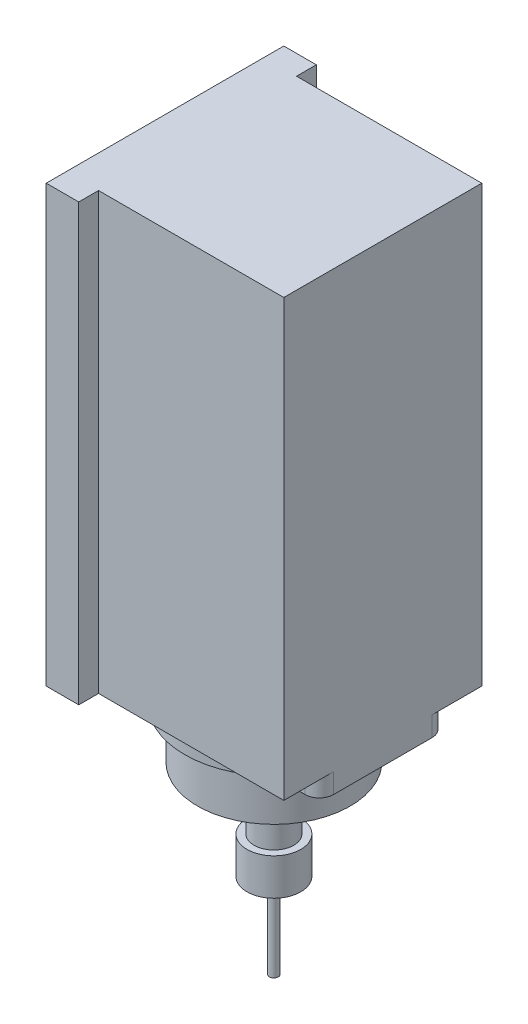
ISO-10303-21;
HEADER;
FILE_DESCRIPTION(('STEP AP214'),'2;1');
FILE_NAME('part.step','',(''),(''),'','','');
FILE_SCHEMA(('AUTOMOTIVE_DESIGN { 1 0 10303 214 1 1 1 1 }'));
ENDSEC;
DATA;
#1=APPLICATION_CONTEXT('core data for automotive mechanical design processes');
#2=APPLICATION_PROTOCOL_DEFINITION('international standard','automotive_design',2000,#1);
#3=PRODUCT_CONTEXT('',#1,'mechanical');
#4=PRODUCT('Part','Part','',(#3));
#5=PRODUCT_RELATED_PRODUCT_CATEGORY('part','',(#4));
#6=PRODUCT_DEFINITION_FORMATION('','',#4);
#7=PRODUCT_DEFINITION_CONTEXT('part definition',#1,'design');
#8=PRODUCT_DEFINITION('design','',#6,#7);
#9=PRODUCT_DEFINITION_SHAPE('','',#8);
#10=(LENGTH_UNIT() NAMED_UNIT(*) SI_UNIT(.MILLI.,.METRE.));
#11=(NAMED_UNIT(*) PLANE_ANGLE_UNIT() SI_UNIT($,.RADIAN.));
#12=(NAMED_UNIT(*) SI_UNIT($,.STERADIAN.) SOLID_ANGLE_UNIT());
#13=UNCERTAINTY_MEASURE_WITH_UNIT(LENGTH_MEASURE(1.E-05),#10,'distance_accuracy_value','');
#14=(GEOMETRIC_REPRESENTATION_CONTEXT(3) GLOBAL_UNCERTAINTY_ASSIGNED_CONTEXT((#13)) GLOBAL_UNIT_ASSIGNED_CONTEXT((#10,
#11,#12)) REPRESENTATION_CONTEXT('',''));
#15=CARTESIAN_POINT('',(0.,0.,0.));
#16=DIRECTION('',(0.,0.,1.));
#17=DIRECTION('',(1.,0.,0.));
#18=AXIS2_PLACEMENT_3D('',#15,#16,#17);
#19=CARTESIAN_POINT('',(0.,0.,0.));
#20=DIRECTION('',(0.,1.,0.));
#21=DIRECTION('',(0.,0.,1.));
#22=AXIS2_PLACEMENT_3D('',#19,#20,#21);
#23=PLANE('',#22);
#24=CARTESIAN_POINT('',(33.5,0.,-17.4264705882353));
#25=DIRECTION('',(0.,-1.,0.));
#26=DIRECTION('',(0.,0.,-1.));
#27=AXIS2_PLACEMENT_3D('',#24,#25,#26);
#28=CIRCLE('',#27,5.);
#29=CARTESIAN_POINT('',(33.5,0.,-22.4264705882353));
#30=VERTEX_POINT('',#29);
#31=CARTESIAN_POINT('',(38.5,0.,-17.4264705882353));
#32=VERTEX_POINT('',#31);
#33=EDGE_CURVE('E49',#30,#32,#28,.T.);
#34=ORIENTED_EDGE('',*,*,#33,.F.);
#35=DIRECTION('',(1.,0.,0.));
#36=VECTOR('',#35,1.);
#37=CARTESIAN_POINT('',(22.1202038181165,0.,-22.4264705882353));
#38=LINE('',#37,#36);
#39=CARTESIAN_POINT('',(22.1202038181165,0.,-22.4264705882353));
#40=VERTEX_POINT('',#39);
#41=EDGE_CURVE('E53',#40,#30,#38,.T.);
#42=ORIENTED_EDGE('',*,*,#41,.F.);
#43=CARTESIAN_POINT('',(0.,0.,0.));
#44=DIRECTION('',(0.,-1.,0.));
#45=DIRECTION('',(0.,0.,-1.));
#46=AXIS2_PLACEMENT_3D('',#43,#44,#45);
#47=CIRCLE('',#46,31.5);
#48=CARTESIAN_POINT('',(-22.1202038181165,0.,-22.4264705882353));
#49=VERTEX_POINT('',#48);
#50=EDGE_CURVE('E311',#49,#40,#47,.T.);
#51=ORIENTED_EDGE('',*,*,#50,.F.);
#52=DIRECTION('',(1.,0.,0.));
#53=VECTOR('',#52,1.);
#54=CARTESIAN_POINT('',(-33.5,0.,-22.4264705882353));
#55=LINE('',#54,#53);
#56=CARTESIAN_POINT('',(-33.5,0.,-22.4264705882353));
#57=VERTEX_POINT('',#56);
#58=EDGE_CURVE('E308',#57,#49,#55,.T.);
#59=ORIENTED_EDGE('',*,*,#58,.F.);
#60=CARTESIAN_POINT('',(-33.5,0.,-17.4264705882353));
#61=DIRECTION('',(0.,-1.,0.));
#62=DIRECTION('',(0.,0.,-1.));
#63=AXIS2_PLACEMENT_3D('',#60,#61,#62);
#64=CIRCLE('',#63,5.);
#65=CARTESIAN_POINT('',(-38.5,0.,-17.4264705882353));
#66=VERTEX_POINT('',#65);
#67=EDGE_CURVE('E305',#66,#57,#64,.T.);
#68=ORIENTED_EDGE('',*,*,#67,.F.);
#69=DIRECTION('',(0.,0.,1.));
#70=VECTOR('',#69,1.);
#71=CARTESIAN_POINT('',(-38.5,0.,-35.));
#72=LINE('',#71,#70);
#73=CARTESIAN_POINT('',(-38.5,0.,-42.));
#74=VERTEX_POINT('',#73);
#75=EDGE_CURVE('E204',#74,#66,#72,.T.);
#76=ORIENTED_EDGE('',*,*,#75,.F.);
#77=DIRECTION('',(-1.,0.,0.));
#78=VECTOR('',#77,1.);
#79=CARTESIAN_POINT('',(-38.5,0.,-42.));
#80=LINE('',#79,#78);
#81=CARTESIAN_POINT('',(-27.,0.,-42.));
#82=VERTEX_POINT('',#81);
#83=EDGE_CURVE('E231',#82,#74,#80,.T.);
#84=ORIENTED_EDGE('',*,*,#83,.F.);
#85=DIRECTION('',(0.,0.,-1.));
#86=VECTOR('',#85,1.);
#87=CARTESIAN_POINT('',(-27.,0.,-42.));
#88=LINE('',#87,#86);
#89=CARTESIAN_POINT('',(-27.,0.,-35.));
#90=VERTEX_POINT('',#89);
#91=EDGE_CURVE('E229',#90,#82,#88,.T.);
#92=ORIENTED_EDGE('',*,*,#91,.F.);
#93=DIRECTION('',(-1.,0.,0.));
#94=VECTOR('',#93,1.);
#95=CARTESIAN_POINT('',(-27.,0.,-35.));
#96=LINE('',#95,#94);
#97=CARTESIAN_POINT('',(38.5,0.,-35.));
#98=VERTEX_POINT('',#97);
#99=EDGE_CURVE('E227',#98,#90,#96,.T.);
#100=ORIENTED_EDGE('',*,*,#99,.F.);
#101=DIRECTION('',(0.,0.,-1.));
#102=VECTOR('',#101,1.);
#103=CARTESIAN_POINT('',(38.5,0.,-35.));
#104=LINE('',#103,#102);
#105=EDGE_CURVE('E223',#32,#98,#104,.T.);
#106=ORIENTED_EDGE('',*,*,#105,.F.);
#107=EDGE_LOOP('',(#34,#42,#51,#59,#68,#76,#84,#92,#100,#106));
#108=FACE_BOUND('',#107,.T.);
#109=ADVANCED_FACE('F32',(#108),#23,.F.);
#110=CARTESIAN_POINT('',(33.5,0.,17.4264705882353));
#111=DIRECTION('',(0.,-1.,0.));
#112=DIRECTION('',(0.,0.,1.));
#113=AXIS2_PLACEMENT_3D('',#110,#111,#112);
#114=CIRCLE('',#113,5.);
#115=CARTESIAN_POINT('',(38.5,0.,17.4264705882353));
#116=VERTEX_POINT('',#115);
#117=CARTESIAN_POINT('',(33.5,0.,22.4264705882353));
#118=VERTEX_POINT('',#117);
#119=EDGE_CURVE('E192',#116,#118,#114,.T.);
#120=ORIENTED_EDGE('',*,*,#119,.F.);
#121=CARTESIAN_POINT('',(38.5,0.,35.));
#122=VERTEX_POINT('',#121);
#123=EDGE_CURVE('E224',#122,#116,#104,.T.);
#124=ORIENTED_EDGE('',*,*,#123,.F.);
#125=DIRECTION('',(1.,0.,0.));
#126=VECTOR('',#125,1.);
#127=CARTESIAN_POINT('',(-27.,0.,35.));
#128=LINE('',#127,#126);
#129=CARTESIAN_POINT('',(-27.,0.,35.));
#130=VERTEX_POINT('',#129);
#131=EDGE_CURVE('E221',#130,#122,#128,.T.);
#132=ORIENTED_EDGE('',*,*,#131,.F.);
#133=DIRECTION('',(0.,0.,-1.));
#134=VECTOR('',#133,1.);
#135=CARTESIAN_POINT('',(-27.,0.,42.));
#136=LINE('',#135,#134);
#137=CARTESIAN_POINT('',(-27.,0.,42.));
#138=VERTEX_POINT('',#137);
#139=EDGE_CURVE('E195',#138,#130,#136,.T.);
#140=ORIENTED_EDGE('',*,*,#139,.F.);
#141=DIRECTION('',(1.,0.,0.));
#142=VECTOR('',#141,1.);
#143=CARTESIAN_POINT('',(-38.5,0.,42.));
#144=LINE('',#143,#142);
#145=CARTESIAN_POINT('',(-38.5,0.,42.));
#146=VERTEX_POINT('',#145);
#147=EDGE_CURVE('E193',#146,#138,#144,.T.);
#148=ORIENTED_EDGE('',*,*,#147,.F.);
#149=CARTESIAN_POINT('',(-38.5,0.,17.4264705882353));
#150=VERTEX_POINT('',#149);
#151=EDGE_CURVE('E233',#150,#146,#72,.T.);
#152=ORIENTED_EDGE('',*,*,#151,.F.);
#153=CARTESIAN_POINT('',(-33.5,0.,17.4264705882353));
#154=DIRECTION('',(0.,-1.,0.));
#155=DIRECTION('',(0.,0.,-1.));
#156=AXIS2_PLACEMENT_3D('',#153,#154,#155);
#157=CIRCLE('',#156,5.);
#158=CARTESIAN_POINT('',(-33.5,0.,22.4264705882353));
#159=VERTEX_POINT('',#158);
#160=EDGE_CURVE('E302',#159,#150,#157,.T.);
#161=ORIENTED_EDGE('',*,*,#160,.F.);
#162=DIRECTION('',(-1.,0.,0.));
#163=VECTOR('',#162,1.);
#164=CARTESIAN_POINT('',(-33.5,0.,22.4264705882353));
#165=LINE('',#164,#163);
#166=CARTESIAN_POINT('',(-22.1202038181165,0.,22.4264705882353));
#167=VERTEX_POINT('',#166);
#168=EDGE_CURVE('E299',#167,#159,#165,.T.);
#169=ORIENTED_EDGE('',*,*,#168,.F.);
#170=CARTESIAN_POINT('',(0.,0.,0.));
#171=DIRECTION('',(0.,-1.,0.));
#172=DIRECTION('',(0.,0.,-1.));
#173=AXIS2_PLACEMENT_3D('',#170,#171,#172);
#174=CIRCLE('',#173,31.5);
#175=CARTESIAN_POINT('',(22.1202038181165,0.,22.4264705882353));
#176=VERTEX_POINT('',#175);
#177=EDGE_CURVE('E296',#176,#167,#174,.T.);
#178=ORIENTED_EDGE('',*,*,#177,.F.);
#179=DIRECTION('',(-1.,0.,0.));
#180=VECTOR('',#179,1.);
#181=CARTESIAN_POINT('',(22.1202038181165,0.,22.4264705882353));
#182=LINE('',#181,#180);
#183=EDGE_CURVE('E294',#118,#176,#182,.T.);
#184=ORIENTED_EDGE('',*,*,#183,.F.);
#185=EDGE_LOOP('',(#120,#124,#132,#140,#148,#152,#161,#169,#178,#184));
#186=FACE_BOUND('',#185,.T.);
#187=ADVANCED_FACE('F348',(#186),#23,.F.);
#188=CARTESIAN_POINT('',(-38.5,154.,42.));
#189=DIRECTION('',(0.,0.,-1.));
#190=DIRECTION('',(-1.,0.,0.));
#191=AXIS2_PLACEMENT_3D('',#188,#189,#190);
#192=PLANE('',#191);
#193=ORIENTED_EDGE('',*,*,#147,.T.);
#194=DIRECTION('',(0.,-1.,0.));
#195=VECTOR('',#194,1.);
#196=CARTESIAN_POINT('',(-27.,154.,42.));
#197=LINE('',#196,#195);
#198=CARTESIAN_POINT('',(-27.,154.,42.));
#199=VERTEX_POINT('',#198);
#200=EDGE_CURVE('E252',#199,#138,#197,.T.);
#201=ORIENTED_EDGE('',*,*,#200,.F.);
#202=DIRECTION('',(1.,0.,0.));
#203=VECTOR('',#202,1.);
#204=CARTESIAN_POINT('',(-38.5,154.,42.));
#205=LINE('',#204,#203);
#206=CARTESIAN_POINT('',(-38.5,154.,42.));
#207=VERTEX_POINT('',#206);
#208=EDGE_CURVE('E203',#207,#199,#205,.T.);
#209=ORIENTED_EDGE('',*,*,#208,.F.);
#210=DIRECTION('',(0.,-1.,0.));
#211=VECTOR('',#210,1.);
#212=CARTESIAN_POINT('',(-38.5,154.,42.));
#213=LINE('',#212,#211);
#214=EDGE_CURVE('E36',#207,#146,#213,.T.);
#215=ORIENTED_EDGE('',*,*,#214,.T.);
#216=EDGE_LOOP('',(#193,#201,#209,#215));
#217=FACE_BOUND('',#216,.T.);
#218=ADVANCED_FACE('F34',(#217),#192,.F.);
#219=CARTESIAN_POINT('',(-27.,154.,42.));
#220=DIRECTION('',(-1.,0.,0.));
#221=DIRECTION('',(0.,0.,1.));
#222=AXIS2_PLACEMENT_3D('',#219,#220,#221);
#223=PLANE('',#222);
#224=ORIENTED_EDGE('',*,*,#139,.T.);
#225=DIRECTION('',(0.,-1.,0.));
#226=VECTOR('',#225,1.);
#227=CARTESIAN_POINT('',(-27.,154.,35.));
#228=LINE('',#227,#226);
#229=CARTESIAN_POINT('',(-27.,154.,35.));
#230=VERTEX_POINT('',#229);
#231=EDGE_CURVE('E250',#230,#130,#228,.T.);
#232=ORIENTED_EDGE('',*,*,#231,.F.);
#233=DIRECTION('',(0.,0.,-1.));
#234=VECTOR('',#233,1.);
#235=CARTESIAN_POINT('',(-27.,154.,42.));
#236=LINE('',#235,#234);
#237=EDGE_CURVE('E206',#199,#230,#236,.T.);
#238=ORIENTED_EDGE('',*,*,#237,.F.);
#239=ORIENTED_EDGE('',*,*,#200,.T.);
#240=EDGE_LOOP('',(#224,#232,#238,#239));
#241=FACE_BOUND('',#240,.T.);
#242=ADVANCED_FACE('F387',(#241),#223,.F.);
#243=CARTESIAN_POINT('',(-27.,154.,35.));
#244=DIRECTION('',(0.,0.,-1.));
#245=DIRECTION('',(-1.,0.,0.));
#246=AXIS2_PLACEMENT_3D('',#243,#244,#245);
#247=PLANE('',#246);
#248=ORIENTED_EDGE('',*,*,#131,.T.);
#249=DIRECTION('',(0.,-1.,0.));
#250=VECTOR('',#249,1.);
#251=CARTESIAN_POINT('',(38.5,154.,35.));
#252=LINE('',#251,#250);
#253=CARTESIAN_POINT('',(38.5,154.,35.));
#254=VERTEX_POINT('',#253);
#255=EDGE_CURVE('E247',#254,#122,#252,.T.);
#256=ORIENTED_EDGE('',*,*,#255,.F.);
#257=DIRECTION('',(1.,0.,0.));
#258=VECTOR('',#257,1.);
#259=CARTESIAN_POINT('',(-27.,154.,35.));
#260=LINE('',#259,#258);
#261=EDGE_CURVE('E208',#230,#254,#260,.T.);
#262=ORIENTED_EDGE('',*,*,#261,.F.);
#263=ORIENTED_EDGE('',*,*,#231,.T.);
#264=EDGE_LOOP('',(#248,#256,#262,#263));
#265=FACE_BOUND('',#264,.T.);
#266=ADVANCED_FACE('F384',(#265),#247,.F.);
#267=CARTESIAN_POINT('',(38.5,154.,-35.));
#268=DIRECTION('',(-1.,0.,0.));
#269=DIRECTION('',(0.,0.,1.));
#270=AXIS2_PLACEMENT_3D('',#267,#268,#269);
#271=PLANE('',#270);
#272=ORIENTED_EDGE('',*,*,#123,.T.);
#273=DIRECTION('',(0.,1.,0.));
#274=VECTOR('',#273,1.);
#275=CARTESIAN_POINT('',(38.5,-7.,17.4264705882353));
#276=LINE('',#275,#274);
#277=CARTESIAN_POINT('',(38.5,-7.,17.4264705882353));
#278=VERTEX_POINT('',#277);
#279=EDGE_CURVE('E292',#278,#116,#276,.T.);
#280=ORIENTED_EDGE('',*,*,#279,.F.);
#281=DIRECTION('',(0.,0.,1.));
#282=VECTOR('',#281,1.);
#283=CARTESIAN_POINT('',(38.5,-7.,17.4264705882353));
#284=LINE('',#283,#282);
#285=CARTESIAN_POINT('',(38.5,-7.,-17.4264705882353));
#286=VERTEX_POINT('',#285);
#287=EDGE_CURVE('E186',#286,#278,#284,.T.);
#288=ORIENTED_EDGE('',*,*,#287,.F.);
#289=DIRECTION('',(0.,1.,0.));
#290=VECTOR('',#289,1.);
#291=CARTESIAN_POINT('',(38.5,-7.,-17.4264705882353));
#292=LINE('',#291,#290);
#293=EDGE_CURVE('E316',#286,#32,#292,.T.);
#294=ORIENTED_EDGE('',*,*,#293,.T.);
#295=ORIENTED_EDGE('',*,*,#105,.T.);
#296=DIRECTION('',(0.,-1.,0.));
#297=VECTOR('',#296,1.);
#298=CARTESIAN_POINT('',(38.5,154.,-35.));
#299=LINE('',#298,#297);
#300=CARTESIAN_POINT('',(38.5,154.,-35.));
#301=VERTEX_POINT('',#300);
#302=EDGE_CURVE('E244',#301,#98,#299,.T.);
#303=ORIENTED_EDGE('',*,*,#302,.F.);
#304=DIRECTION('',(0.,0.,-1.));
#305=VECTOR('',#304,1.);
#306=CARTESIAN_POINT('',(38.5,154.,-35.));
#307=LINE('',#306,#305);
#308=EDGE_CURVE('E210',#254,#301,#307,.T.);
#309=ORIENTED_EDGE('',*,*,#308,.F.);
#310=ORIENTED_EDGE('',*,*,#255,.T.);
#311=EDGE_LOOP('',(#272,#280,#288,#294,#295,#303,#309,#310));
#312=FACE_BOUND('',#311,.T.);
#313=ADVANCED_FACE('F378',(#312),#271,.F.);
#314=CARTESIAN_POINT('',(-27.,154.,-35.));
#315=DIRECTION('',(0.,0.,1.));
#316=DIRECTION('',(1.,0.,0.));
#317=AXIS2_PLACEMENT_3D('',#314,#315,#316);
#318=PLANE('',#317);
#319=ORIENTED_EDGE('',*,*,#99,.T.);
#320=DIRECTION('',(0.,-1.,0.));
#321=VECTOR('',#320,1.);
#322=CARTESIAN_POINT('',(-27.,154.,-35.));
#323=LINE('',#322,#321);
#324=CARTESIAN_POINT('',(-27.,154.,-35.));
#325=VERTEX_POINT('',#324);
#326=EDGE_CURVE('E241',#325,#90,#323,.T.);
#327=ORIENTED_EDGE('',*,*,#326,.F.);
#328=DIRECTION('',(-1.,0.,0.));
#329=VECTOR('',#328,1.);
#330=CARTESIAN_POINT('',(-27.,154.,-35.));
#331=LINE('',#330,#329);
#332=EDGE_CURVE('E212',#301,#325,#331,.T.);
#333=ORIENTED_EDGE('',*,*,#332,.F.);
#334=ORIENTED_EDGE('',*,*,#302,.T.);
#335=EDGE_LOOP('',(#319,#327,#333,#334));
#336=FACE_BOUND('',#335,.T.);
#337=ADVANCED_FACE('F411',(#336),#318,.F.);
#338=CARTESIAN_POINT('',(-27.,154.,-42.));
#339=DIRECTION('',(-1.,0.,0.));
#340=DIRECTION('',(0.,0.,1.));
#341=AXIS2_PLACEMENT_3D('',#338,#339,#340);
#342=PLANE('',#341);
#343=ORIENTED_EDGE('',*,*,#91,.T.);
#344=DIRECTION('',(0.,-1.,0.));
#345=VECTOR('',#344,1.);
#346=CARTESIAN_POINT('',(-27.,154.,-42.));
#347=LINE('',#346,#345);
#348=CARTESIAN_POINT('',(-27.,154.,-42.));
#349=VERTEX_POINT('',#348);
#350=EDGE_CURVE('E238',#349,#82,#347,.T.);
#351=ORIENTED_EDGE('',*,*,#350,.F.);
#352=DIRECTION('',(0.,0.,-1.));
#353=VECTOR('',#352,1.);
#354=CARTESIAN_POINT('',(-27.,154.,-42.));
#355=LINE('',#354,#353);
#356=EDGE_CURVE('E214',#325,#349,#355,.T.);
#357=ORIENTED_EDGE('',*,*,#356,.F.);
#358=ORIENTED_EDGE('',*,*,#326,.T.);
#359=EDGE_LOOP('',(#343,#351,#357,#358));
#360=FACE_BOUND('',#359,.T.);
#361=ADVANCED_FACE('F407',(#360),#342,.F.);
#362=CARTESIAN_POINT('',(-38.5,154.,-42.));
#363=DIRECTION('',(0.,0.,1.));
#364=DIRECTION('',(1.,0.,0.));
#365=AXIS2_PLACEMENT_3D('',#362,#363,#364);
#366=PLANE('',#365);
#367=ORIENTED_EDGE('',*,*,#83,.T.);
#368=DIRECTION('',(0.,-1.,0.));
#369=VECTOR('',#368,1.);
#370=CARTESIAN_POINT('',(-38.5,154.,-42.));
#371=LINE('',#370,#369);
#372=CARTESIAN_POINT('',(-38.5,154.,-42.));
#373=VERTEX_POINT('',#372);
#374=EDGE_CURVE('E218',#373,#74,#371,.T.);
#375=ORIENTED_EDGE('',*,*,#374,.F.);
#376=DIRECTION('',(-1.,0.,0.));
#377=VECTOR('',#376,1.);
#378=CARTESIAN_POINT('',(-38.5,154.,-42.));
#379=LINE('',#378,#377);
#380=EDGE_CURVE('E216',#349,#373,#379,.T.);
#381=ORIENTED_EDGE('',*,*,#380,.F.);
#382=ORIENTED_EDGE('',*,*,#350,.T.);
#383=EDGE_LOOP('',(#367,#375,#381,#382));
#384=FACE_BOUND('',#383,.T.);
#385=ADVANCED_FACE('F404',(#384),#366,.F.);
#386=CARTESIAN_POINT('',(-38.5,154.,-35.));
#387=DIRECTION('',(1.,0.,0.));
#388=DIRECTION('',(0.,0.,-1.));
#389=AXIS2_PLACEMENT_3D('',#386,#387,#388);
#390=PLANE('',#389);
#391=ORIENTED_EDGE('',*,*,#75,.T.);
#392=DIRECTION('',(0.,1.,0.));
#393=VECTOR('',#392,1.);
#394=CARTESIAN_POINT('',(-38.5,-7.,-17.4264705882353));
#395=LINE('',#394,#393);
#396=CARTESIAN_POINT('',(-38.5,-7.,-17.4264705882353));
#397=VERTEX_POINT('',#396);
#398=EDGE_CURVE('E331',#397,#66,#395,.T.);
#399=ORIENTED_EDGE('',*,*,#398,.F.);
#400=DIRECTION('',(0.,0.,-1.));
#401=VECTOR('',#400,1.);
#402=CARTESIAN_POINT('',(-38.5,-7.,17.4264705882353));
#403=LINE('',#402,#401);
#404=CARTESIAN_POINT('',(-38.5,-7.,17.4264705882353));
#405=VERTEX_POINT('',#404);
#406=EDGE_CURVE('E279',#405,#397,#403,.T.);
#407=ORIENTED_EDGE('',*,*,#406,.F.);
#408=DIRECTION('',(0.,1.,0.));
#409=VECTOR('',#408,1.);
#410=CARTESIAN_POINT('',(-38.5,-7.,17.4264705882353));
#411=LINE('',#410,#409);
#412=EDGE_CURVE('E334',#405,#150,#411,.T.);
#413=ORIENTED_EDGE('',*,*,#412,.T.);
#414=ORIENTED_EDGE('',*,*,#151,.T.);
#415=ORIENTED_EDGE('',*,*,#214,.F.);
#416=DIRECTION('',(0.,0.,1.));
#417=VECTOR('',#416,1.);
#418=CARTESIAN_POINT('',(-38.5,154.,-35.));
#419=LINE('',#418,#417);
#420=EDGE_CURVE('E201',#373,#207,#419,.T.);
#421=ORIENTED_EDGE('',*,*,#420,.F.);
#422=ORIENTED_EDGE('',*,*,#374,.T.);
#423=EDGE_LOOP('',(#391,#399,#407,#413,#414,#415,#421,#422));
#424=FACE_BOUND('',#423,.T.);
#425=ADVANCED_FACE('F355',(#424),#390,.F.);
#426=CARTESIAN_POINT('',(0.,154.,0.));
#427=DIRECTION('',(0.,1.,0.));
#428=DIRECTION('',(0.,0.,1.));
#429=AXIS2_PLACEMENT_3D('',#426,#427,#428);
#430=PLANE('',#429);
#431=ORIENTED_EDGE('',*,*,#420,.T.);
#432=ORIENTED_EDGE('',*,*,#208,.T.);
#433=ORIENTED_EDGE('',*,*,#237,.T.);
#434=ORIENTED_EDGE('',*,*,#261,.T.);
#435=ORIENTED_EDGE('',*,*,#308,.T.);
#436=ORIENTED_EDGE('',*,*,#332,.T.);
#437=ORIENTED_EDGE('',*,*,#356,.T.);
#438=ORIENTED_EDGE('',*,*,#380,.T.);
#439=EDGE_LOOP('',(#431,#432,#433,#434,#435,#436,#437,#438));
#440=FACE_BOUND('',#439,.T.);
#441=ADVANCED_FACE('F389',(#440),#430,.T.);
#442=CARTESIAN_POINT('',(33.5,-7.,17.4264705882353));
#443=DIRECTION('',(0.,1.,0.));
#444=DIRECTION('',(0.,0.,1.));
#445=AXIS2_PLACEMENT_3D('',#442,#443,#444);
#446=CYLINDRICAL_SURFACE('',#445,5.);
#447=ORIENTED_EDGE('',*,*,#119,.T.);
#448=DIRECTION('',(0.,1.,0.));
#449=VECTOR('',#448,1.);
#450=CARTESIAN_POINT('',(33.5,-7.,22.4264705882353));
#451=LINE('',#450,#449);
#452=CARTESIAN_POINT('',(33.5,-7.,22.4264705882353));
#453=VERTEX_POINT('',#452);
#454=EDGE_CURVE('E174',#453,#118,#451,.T.);
#455=ORIENTED_EDGE('',*,*,#454,.F.);
#456=CARTESIAN_POINT('',(33.5,-7.,17.4264705882353));
#457=DIRECTION('',(0.,-1.,0.));
#458=DIRECTION('',(0.,0.,1.));
#459=AXIS2_PLACEMENT_3D('',#456,#457,#458);
#460=CIRCLE('',#459,5.);
#461=EDGE_CURVE('E181',#278,#453,#460,.T.);
#462=ORIENTED_EDGE('',*,*,#461,.F.);
#463=ORIENTED_EDGE('',*,*,#279,.T.);
#464=EDGE_LOOP('',(#447,#455,#462,#463));
#465=FACE_BOUND('',#464,.T.);
#466=ADVANCED_FACE('F191',(#465),#446,.T.);
#467=CARTESIAN_POINT('',(22.1202038181165,-7.,22.4264705882353));
#468=DIRECTION('',(0.,0.,-1.));
#469=DIRECTION('',(-1.,0.,0.));
#470=AXIS2_PLACEMENT_3D('',#467,#468,#469);
#471=PLANE('',#470);
#472=ORIENTED_EDGE('',*,*,#183,.T.);
#473=DIRECTION('',(0.,1.,0.));
#474=VECTOR('',#473,1.);
#475=CARTESIAN_POINT('',(22.1202038181165,-7.,22.4264705882353));
#476=LINE('',#475,#474);
#477=CARTESIAN_POINT('',(22.1202038181165,-7.,22.4264705882353));
#478=VERTEX_POINT('',#477);
#479=EDGE_CURVE('E177',#478,#176,#476,.T.);
#480=ORIENTED_EDGE('',*,*,#479,.F.);
#481=DIRECTION('',(-1.,0.,0.));
#482=VECTOR('',#481,1.);
#483=CARTESIAN_POINT('',(22.1202038181165,-7.,22.4264705882353));
#484=LINE('',#483,#482);
#485=EDGE_CURVE('E169',#453,#478,#484,.T.);
#486=ORIENTED_EDGE('',*,*,#485,.F.);
#487=ORIENTED_EDGE('',*,*,#454,.T.);
#488=EDGE_LOOP('',(#472,#480,#486,#487));
#489=FACE_BOUND('',#488,.T.);
#490=ADVANCED_FACE('F172',(#489),#471,.F.);
#491=CARTESIAN_POINT('',(0.,-7.,0.));
#492=DIRECTION('',(0.,1.,0.));
#493=DIRECTION('',(0.,0.,1.));
#494=AXIS2_PLACEMENT_3D('',#491,#492,#493);
#495=CYLINDRICAL_SURFACE('',#494,31.5);
#496=ORIENTED_EDGE('',*,*,#177,.T.);
#497=DIRECTION('',(0.,1.,0.));
#498=VECTOR('',#497,1.);
#499=CARTESIAN_POINT('',(-22.1202038181165,-7.,22.4264705882353));
#500=LINE('',#499,#498);
#501=CARTESIAN_POINT('',(-22.1202038181165,-7.,22.4264705882353));
#502=VERTEX_POINT('',#501);
#503=EDGE_CURVE('E197',#502,#167,#500,.T.);
#504=ORIENTED_EDGE('',*,*,#503,.F.);
#505=CARTESIAN_POINT('',(0.,-7.,0.));
#506=DIRECTION('',(0.,-1.,0.));
#507=DIRECTION('',(0.,0.,-1.));
#508=AXIS2_PLACEMENT_3D('',#505,#506,#507);
#509=CIRCLE('',#508,31.5);
#510=EDGE_CURVE('E180',#478,#502,#509,.T.);
#511=ORIENTED_EDGE('',*,*,#510,.F.);
#512=ORIENTED_EDGE('',*,*,#479,.T.);
#513=EDGE_LOOP('',(#496,#504,#511,#512));
#514=FACE_BOUND('',#513,.T.);
#515=ADVANCED_FACE('F346',(#514),#495,.T.);
#516=CARTESIAN_POINT('',(-33.5,-7.,22.4264705882353));
#517=DIRECTION('',(0.,0.,-1.));
#518=DIRECTION('',(-1.,0.,0.));
#519=AXIS2_PLACEMENT_3D('',#516,#517,#518);
#520=PLANE('',#519);
#521=ORIENTED_EDGE('',*,*,#168,.T.);
#522=DIRECTION('',(0.,1.,0.));
#523=VECTOR('',#522,1.);
#524=CARTESIAN_POINT('',(-33.5,-7.,22.4264705882353));
#525=LINE('',#524,#523);
#526=CARTESIAN_POINT('',(-33.5,-7.,22.4264705882353));
#527=VERTEX_POINT('',#526);
#528=EDGE_CURVE('E337',#527,#159,#525,.T.);
#529=ORIENTED_EDGE('',*,*,#528,.F.);
#530=DIRECTION('',(-1.,0.,0.));
#531=VECTOR('',#530,1.);
#532=CARTESIAN_POINT('',(-33.5,-7.,22.4264705882353));
#533=LINE('',#532,#531);
#534=EDGE_CURVE('E275',#502,#527,#533,.T.);
#535=ORIENTED_EDGE('',*,*,#534,.F.);
#536=ORIENTED_EDGE('',*,*,#503,.T.);
#537=EDGE_LOOP('',(#521,#529,#535,#536));
#538=FACE_BOUND('',#537,.T.);
#539=ADVANCED_FACE('F343',(#538),#520,.F.);
#540=CARTESIAN_POINT('',(-33.5,-7.,17.4264705882353));
#541=DIRECTION('',(0.,1.,0.));
#542=DIRECTION('',(0.,0.,1.));
#543=AXIS2_PLACEMENT_3D('',#540,#541,#542);
#544=CYLINDRICAL_SURFACE('',#543,5.);
#545=ORIENTED_EDGE('',*,*,#160,.T.);
#546=ORIENTED_EDGE('',*,*,#412,.F.);
#547=CARTESIAN_POINT('',(-33.5,-7.,17.4264705882353));
#548=DIRECTION('',(0.,-1.,0.));
#549=DIRECTION('',(0.,0.,-1.));
#550=AXIS2_PLACEMENT_3D('',#547,#548,#549);
#551=CIRCLE('',#550,5.);
#552=EDGE_CURVE('E277',#527,#405,#551,.T.);
#553=ORIENTED_EDGE('',*,*,#552,.F.);
#554=ORIENTED_EDGE('',*,*,#528,.T.);
#555=EDGE_LOOP('',(#545,#546,#553,#554));
#556=FACE_BOUND('',#555,.T.);
#557=ADVANCED_FACE('F351',(#556),#544,.T.);
#558=CARTESIAN_POINT('',(-33.5,-7.,-17.4264705882353));
#559=DIRECTION('',(0.,1.,0.));
#560=DIRECTION('',(0.,0.,1.));
#561=AXIS2_PLACEMENT_3D('',#558,#559,#560);
#562=CYLINDRICAL_SURFACE('',#561,5.);
#563=ORIENTED_EDGE('',*,*,#67,.T.);
#564=DIRECTION('',(0.,1.,0.));
#565=VECTOR('',#564,1.);
#566=CARTESIAN_POINT('',(-33.5,-7.,-22.4264705882353));
#567=LINE('',#566,#565);
#568=CARTESIAN_POINT('',(-33.5,-7.,-22.4264705882353));
#569=VERTEX_POINT('',#568);
#570=EDGE_CURVE('E328',#569,#57,#567,.T.);
#571=ORIENTED_EDGE('',*,*,#570,.F.);
#572=CARTESIAN_POINT('',(-33.5,-7.,-17.4264705882353));
#573=DIRECTION('',(0.,-1.,0.));
#574=DIRECTION('',(0.,0.,-1.));
#575=AXIS2_PLACEMENT_3D('',#572,#573,#574);
#576=CIRCLE('',#575,5.);
#577=EDGE_CURVE('E281',#397,#569,#576,.T.);
#578=ORIENTED_EDGE('',*,*,#577,.F.);
#579=ORIENTED_EDGE('',*,*,#398,.T.);
#580=EDGE_LOOP('',(#563,#571,#578,#579));
#581=FACE_BOUND('',#580,.T.);
#582=ADVANCED_FACE('F362',(#581),#562,.T.);
#583=CARTESIAN_POINT('',(-33.5,-7.,-22.4264705882353));
#584=DIRECTION('',(0.,0.,1.));
#585=DIRECTION('',(1.,0.,0.));
#586=AXIS2_PLACEMENT_3D('',#583,#584,#585);
#587=PLANE('',#586);
#588=ORIENTED_EDGE('',*,*,#58,.T.);
#589=DIRECTION('',(0.,1.,0.));
#590=VECTOR('',#589,1.);
#591=CARTESIAN_POINT('',(-22.1202038181165,-7.,-22.4264705882353));
#592=LINE('',#591,#590);
#593=CARTESIAN_POINT('',(-22.1202038181165,-7.,-22.4264705882353));
#594=VERTEX_POINT('',#593);
#595=EDGE_CURVE('E325',#594,#49,#592,.T.);
#596=ORIENTED_EDGE('',*,*,#595,.F.);
#597=DIRECTION('',(1.,0.,0.));
#598=VECTOR('',#597,1.);
#599=CARTESIAN_POINT('',(-33.5,-7.,-22.4264705882353));
#600=LINE('',#599,#598);
#601=EDGE_CURVE('E283',#569,#594,#600,.T.);
#602=ORIENTED_EDGE('',*,*,#601,.F.);
#603=ORIENTED_EDGE('',*,*,#570,.T.);
#604=EDGE_LOOP('',(#588,#596,#602,#603));
#605=FACE_BOUND('',#604,.T.);
#606=ADVANCED_FACE('F364',(#605),#587,.F.);
#607=CARTESIAN_POINT('',(0.,-7.,0.));
#608=DIRECTION('',(0.,1.,0.));
#609=DIRECTION('',(0.,0.,1.));
#610=AXIS2_PLACEMENT_3D('',#607,#608,#609);
#611=CYLINDRICAL_SURFACE('',#610,31.5);
#612=ORIENTED_EDGE('',*,*,#50,.T.);
#613=DIRECTION('',(0.,1.,0.));
#614=VECTOR('',#613,1.);
#615=CARTESIAN_POINT('',(22.1202038181165,-7.,-22.4264705882353));
#616=LINE('',#615,#614);
#617=CARTESIAN_POINT('',(22.1202038181165,-7.,-22.4264705882353));
#618=VERTEX_POINT('',#617);
#619=EDGE_CURVE('E322',#618,#40,#616,.T.);
#620=ORIENTED_EDGE('',*,*,#619,.F.);
#621=CARTESIAN_POINT('',(0.,-7.,0.));
#622=DIRECTION('',(0.,-1.,0.));
#623=DIRECTION('',(0.,0.,-1.));
#624=AXIS2_PLACEMENT_3D('',#621,#622,#623);
#625=CIRCLE('',#624,31.5);
#626=EDGE_CURVE('E285',#594,#618,#625,.T.);
#627=ORIENTED_EDGE('',*,*,#626,.F.);
#628=ORIENTED_EDGE('',*,*,#595,.T.);
#629=EDGE_LOOP('',(#612,#620,#627,#628));
#630=FACE_BOUND('',#629,.T.);
#631=ADVANCED_FACE('F368',(#630),#611,.T.);
#632=CARTESIAN_POINT('',(22.1202038181165,-7.,-22.4264705882353));
#633=DIRECTION('',(0.,0.,1.));
#634=DIRECTION('',(1.,0.,0.));
#635=AXIS2_PLACEMENT_3D('',#632,#633,#634);
#636=PLANE('',#635);
#637=ORIENTED_EDGE('',*,*,#41,.T.);
#638=DIRECTION('',(0.,1.,0.));
#639=VECTOR('',#638,1.);
#640=CARTESIAN_POINT('',(33.5,-7.,-22.4264705882353));
#641=LINE('',#640,#639);
#642=CARTESIAN_POINT('',(33.5,-7.,-22.4264705882353));
#643=VERTEX_POINT('',#642);
#644=EDGE_CURVE('E319',#643,#30,#641,.T.);
#645=ORIENTED_EDGE('',*,*,#644,.F.);
#646=DIRECTION('',(1.,0.,0.));
#647=VECTOR('',#646,1.);
#648=CARTESIAN_POINT('',(22.1202038181165,-7.,-22.4264705882353));
#649=LINE('',#648,#647);
#650=EDGE_CURVE('E287',#618,#643,#649,.T.);
#651=ORIENTED_EDGE('',*,*,#650,.F.);
#652=ORIENTED_EDGE('',*,*,#619,.T.);
#653=EDGE_LOOP('',(#637,#645,#651,#652));
#654=FACE_BOUND('',#653,.T.);
#655=ADVANCED_FACE('F374',(#654),#636,.F.);
#656=CARTESIAN_POINT('',(33.5,-7.,-17.4264705882353));
#657=DIRECTION('',(0.,1.,0.));
#658=DIRECTION('',(0.,0.,1.));
#659=AXIS2_PLACEMENT_3D('',#656,#657,#658);
#660=CYLINDRICAL_SURFACE('',#659,5.);
#661=ORIENTED_EDGE('',*,*,#33,.T.);
#662=ORIENTED_EDGE('',*,*,#293,.F.);
#663=CARTESIAN_POINT('',(33.5,-7.,-17.4264705882353));
#664=DIRECTION('',(0.,-1.,0.));
#665=DIRECTION('',(0.,0.,-1.));
#666=AXIS2_PLACEMENT_3D('',#663,#664,#665);
#667=CIRCLE('',#666,5.);
#668=EDGE_CURVE('E289',#643,#286,#667,.T.);
#669=ORIENTED_EDGE('',*,*,#668,.F.);
#670=ORIENTED_EDGE('',*,*,#644,.T.);
#671=EDGE_LOOP('',(#661,#662,#669,#670));
#672=FACE_BOUND('',#671,.T.);
#673=ADVANCED_FACE('F376',(#672),#660,.T.);
#674=CARTESIAN_POINT('',(33.5,-7.,17.4264705882353));
#675=DIRECTION('',(0.,1.,0.));
#676=DIRECTION('',(0.,0.,1.));
#677=AXIS2_PLACEMENT_3D('',#674,#675,#676);
#678=PLANE('',#677);
#679=CARTESIAN_POINT('',(0.,-7.,0.));
#680=DIRECTION('',(0.,-1.,0.));
#681=DIRECTION('',(0.,0.,-1.));
#682=AXIS2_PLACEMENT_3D('',#679,#680,#681);
#683=CIRCLE('',#682,27.);
#684=CARTESIAN_POINT('',(0.,-7.,-27.));
#685=VERTEX_POINT('',#684);
#686=EDGE_CURVE('E259',#685,#685,#683,.T.);
#687=ORIENTED_EDGE('',*,*,#686,.F.);
#688=EDGE_LOOP('',(#687));
#689=FACE_BOUND('',#688,.T.);
#690=ORIENTED_EDGE('',*,*,#461,.T.);
#691=ORIENTED_EDGE('',*,*,#485,.T.);
#692=ORIENTED_EDGE('',*,*,#510,.T.);
#693=ORIENTED_EDGE('',*,*,#534,.T.);
#694=ORIENTED_EDGE('',*,*,#552,.T.);
#695=ORIENTED_EDGE('',*,*,#406,.T.);
#696=ORIENTED_EDGE('',*,*,#577,.T.);
#697=ORIENTED_EDGE('',*,*,#601,.T.);
#698=ORIENTED_EDGE('',*,*,#626,.T.);
#699=ORIENTED_EDGE('',*,*,#650,.T.);
#700=ORIENTED_EDGE('',*,*,#668,.T.);
#701=ORIENTED_EDGE('',*,*,#287,.T.);
#702=EDGE_LOOP('',(#690,#691,#692,#693,#694,#695,#696,#697,#698,#699,#700,#701));
#703=FACE_BOUND('',#702,.T.);
#704=ADVANCED_FACE('F184',(#689,#703),#678,.F.);
#705=CARTESIAN_POINT('',(0.,-25.,0.));
#706=DIRECTION('',(0.,1.,0.));
#707=DIRECTION('',(0.,0.,1.));
#708=AXIS2_PLACEMENT_3D('',#705,#706,#707);
#709=CYLINDRICAL_SURFACE('',#708,27.);
#710=CARTESIAN_POINT('',(0.,-25.,0.));
#711=DIRECTION('',(0.,-1.,0.));
#712=DIRECTION('',(0.,0.,-1.));
#713=AXIS2_PLACEMENT_3D('',#710,#711,#712);
#714=CIRCLE('',#713,27.);
#715=CARTESIAN_POINT('',(0.,-25.,-27.));
#716=VERTEX_POINT('',#715);
#717=EDGE_CURVE('E272',#716,#716,#714,.T.);
#718=ORIENTED_EDGE('',*,*,#717,.F.);
#719=EDGE_LOOP('',(#718));
#720=FACE_BOUND('',#719,.T.);
#721=ORIENTED_EDGE('',*,*,#686,.T.);
#722=EDGE_LOOP('',(#721));
#723=FACE_BOUND('',#722,.T.);
#724=ADVANCED_FACE('F514',(#720,#723),#709,.T.);
#725=CARTESIAN_POINT('',(0.,-25.,0.));
#726=DIRECTION('',(0.,-1.,0.));
#727=DIRECTION('',(0.,0.,-1.));
#728=AXIS2_PLACEMENT_3D('',#725,#726,#727);
#729=PLANE('',#728);
#730=CARTESIAN_POINT('',(0.,-25.,0.));
#731=DIRECTION('',(0.,-1.,0.));
#732=DIRECTION('',(0.,0.,-1.));
#733=AXIS2_PLACEMENT_3D('',#730,#731,#732);
#734=CIRCLE('',#733,14.5);
#735=CARTESIAN_POINT('',(0.,-25.,-14.5));
#736=VERTEX_POINT('',#735);
#737=EDGE_CURVE('E265',#736,#736,#734,.T.);
#738=ORIENTED_EDGE('',*,*,#737,.F.);
#739=EDGE_LOOP('',(#738));
#740=FACE_BOUND('',#739,.T.);
#741=ORIENTED_EDGE('',*,*,#717,.T.);
#742=EDGE_LOOP('',(#741));
#743=FACE_BOUND('',#742,.T.);
#744=ADVANCED_FACE('F522',(#740,#743),#729,.T.);
#745=CARTESIAN_POINT('',(0.,-28.,0.));
#746=DIRECTION('',(0.,1.,0.));
#747=DIRECTION('',(0.,0.,1.));
#748=AXIS2_PLACEMENT_3D('',#745,#746,#747);
#749=CYLINDRICAL_SURFACE('',#748,14.5);
#750=CARTESIAN_POINT('',(0.,-28.,0.));
#751=DIRECTION('',(0.,-1.,0.));
#752=DIRECTION('',(0.,0.,-1.));
#753=AXIS2_PLACEMENT_3D('',#750,#751,#752);
#754=CIRCLE('',#753,14.5);
#755=CARTESIAN_POINT('',(0.,-28.,-14.5));
#756=VERTEX_POINT('',#755);
#757=EDGE_CURVE('E696',#756,#756,#754,.T.);
#758=ORIENTED_EDGE('',*,*,#757,.F.);
#759=EDGE_LOOP('',(#758));
#760=FACE_BOUND('',#759,.T.);
#761=ORIENTED_EDGE('',*,*,#737,.T.);
#762=EDGE_LOOP('',(#761));
#763=FACE_BOUND('',#762,.T.);
#764=ADVANCED_FACE('F530',(#760,#763),#749,.T.);
#765=CARTESIAN_POINT('',(0.,-28.,0.));
#766=DIRECTION('',(0.,-1.,0.));
#767=DIRECTION('',(0.,0.,-1.));
#768=AXIS2_PLACEMENT_3D('',#765,#766,#767);
#769=PLANE('',#768);
#770=CARTESIAN_POINT('',(0.,-28.,0.));
#771=DIRECTION('',(0.,-1.,0.));
#772=DIRECTION('',(0.,0.,-1.));
#773=AXIS2_PLACEMENT_3D('',#770,#771,#772);
#774=CIRCLE('',#773,7.);
#775=CARTESIAN_POINT('',(0.,-28.,-7.));
#776=VERTEX_POINT('',#775);
#777=EDGE_CURVE('E41',#776,#776,#774,.T.);
#778=ORIENTED_EDGE('',*,*,#777,.F.);
#779=EDGE_LOOP('',(#778));
#780=FACE_BOUND('',#779,.T.);
#781=ORIENTED_EDGE('',*,*,#757,.T.);
#782=EDGE_LOOP('',(#781));
#783=FACE_BOUND('',#782,.T.);
#784=ADVANCED_FACE('F538',(#780,#783),#769,.T.);
#785=CARTESIAN_POINT('',(0.,-47.,0.));
#786=DIRECTION('',(0.,1.,0.));
#787=DIRECTION('',(0.,0.,1.));
#788=AXIS2_PLACEMENT_3D('',#785,#786,#787);
#789=CYLINDRICAL_SURFACE('',#788,7.);
#790=CARTESIAN_POINT('',(0.,-47.,0.));
#791=DIRECTION('',(0.,-1.,0.));
#792=DIRECTION('',(0.,0.,-1.));
#793=AXIS2_PLACEMENT_3D('',#790,#791,#792);
#794=CIRCLE('',#793,7.);
#795=CARTESIAN_POINT('',(0.,-47.,-7.));
#796=VERTEX_POINT('',#795);
#797=EDGE_CURVE('E692',#796,#796,#794,.T.);
#798=ORIENTED_EDGE('',*,*,#797,.F.);
#799=EDGE_LOOP('',(#798));
#800=FACE_BOUND('',#799,.T.);
#801=ORIENTED_EDGE('',*,*,#777,.T.);
#802=EDGE_LOOP('',(#801));
#803=FACE_BOUND('',#802,.T.);
#804=ADVANCED_FACE('F546',(#800,#803),#789,.T.);
#805=CARTESIAN_POINT('',(0.,-60.,0.));
#806=DIRECTION('',(0.,1.,0.));
#807=DIRECTION('',(0.,0.,1.));
#808=AXIS2_PLACEMENT_3D('',#805,#806,#807);
#809=CYLINDRICAL_SURFACE('',#808,9.5);
#810=CARTESIAN_POINT('',(0.,-60.,0.));
#811=DIRECTION('',(0.,-1.,0.));
#812=DIRECTION('',(0.,0.,-1.));
#813=AXIS2_PLACEMENT_3D('',#810,#811,#812);
#814=CIRCLE('',#813,9.5);
#815=CARTESIAN_POINT('',(0.,-60.,-9.5));
#816=VERTEX_POINT('',#815);
#817=EDGE_CURVE('E688',#816,#816,#814,.T.);
#818=ORIENTED_EDGE('',*,*,#817,.F.);
#819=EDGE_LOOP('',(#818));
#820=FACE_BOUND('',#819,.T.);
#821=CARTESIAN_POINT('',(0.,-47.,0.));
#822=DIRECTION('',(0.,-1.,0.));
#823=DIRECTION('',(0.,0.,-1.));
#824=AXIS2_PLACEMENT_3D('',#821,#822,#823);
#825=CIRCLE('',#824,9.5);
#826=CARTESIAN_POINT('',(0.,-47.,-9.5));
#827=VERTEX_POINT('',#826);
#828=EDGE_CURVE('E685',#827,#827,#825,.T.);
#829=ORIENTED_EDGE('',*,*,#828,.T.);
#830=EDGE_LOOP('',(#829));
#831=FACE_BOUND('',#830,.T.);
#832=ADVANCED_FACE('F554',(#820,#831),#809,.T.);
#833=CARTESIAN_POINT('',(0.,-60.,0.));
#834=DIRECTION('',(0.,-1.,0.));
#835=DIRECTION('',(0.,0.,-1.));
#836=AXIS2_PLACEMENT_3D('',#833,#834,#835);
#837=PLANE('',#836);
#838=CARTESIAN_POINT('',(0.,-60.,0.));
#839=DIRECTION('',(0.,-1.,0.));
#840=DIRECTION('',(0.,0.,-1.));
#841=AXIS2_PLACEMENT_3D('',#838,#839,#840);
#842=CIRCLE('',#841,1.5875);
#843=CARTESIAN_POINT('',(0.,-60.,-1.5875));
#844=VERTEX_POINT('',#843);
#845=EDGE_CURVE('E11',#844,#844,#842,.T.);
#846=ORIENTED_EDGE('',*,*,#845,.F.);
#847=EDGE_LOOP('',(#846));
#848=FACE_BOUND('',#847,.T.);
#849=ORIENTED_EDGE('',*,*,#817,.T.);
#850=EDGE_LOOP('',(#849));
#851=FACE_BOUND('',#850,.T.);
#852=ADVANCED_FACE('F562',(#848,#851),#837,.T.);
#853=CARTESIAN_POINT('',(0.,-47.,0.));
#854=DIRECTION('',(0.,-1.,0.));
#855=DIRECTION('',(0.,0.,-1.));
#856=AXIS2_PLACEMENT_3D('',#853,#854,#855);
#857=PLANE('',#856);
#858=ORIENTED_EDGE('',*,*,#797,.T.);
#859=EDGE_LOOP('',(#858));
#860=FACE_BOUND('',#859,.T.);
#861=ORIENTED_EDGE('',*,*,#828,.F.);
#862=EDGE_LOOP('',(#861));
#863=FACE_BOUND('',#862,.T.);
#864=ADVANCED_FACE('F571',(#860,#863),#857,.F.);
#865=CARTESIAN_POINT('',(0.,-90.,0.));
#866=DIRECTION('',(0.,1.,0.));
#867=DIRECTION('',(0.,0.,1.));
#868=AXIS2_PLACEMENT_3D('',#865,#866,#867);
#869=CYLINDRICAL_SURFACE('',#868,1.5875);
#870=CARTESIAN_POINT('',(0.,-90.,0.));
#871=DIRECTION('',(0.,-1.,0.));
#872=DIRECTION('',(0.,0.,-1.));
#873=AXIS2_PLACEMENT_3D('',#870,#871,#872);
#874=CIRCLE('',#873,1.5875);
#875=CARTESIAN_POINT('',(0.,-90.,-1.5875));
#876=VERTEX_POINT('',#875);
#877=EDGE_CURVE('E684',#876,#876,#874,.T.);
#878=ORIENTED_EDGE('',*,*,#877,.F.);
#879=EDGE_LOOP('',(#878));
#880=FACE_BOUND('',#879,.T.);
#881=ORIENTED_EDGE('',*,*,#845,.T.);
#882=EDGE_LOOP('',(#881));
#883=FACE_BOUND('',#882,.T.);
#884=ADVANCED_FACE('F579',(#880,#883),#869,.T.);
#885=CARTESIAN_POINT('',(0.,-90.,0.));
#886=DIRECTION('',(0.,-1.,0.));
#887=DIRECTION('',(0.,0.,-1.));
#888=AXIS2_PLACEMENT_3D('',#885,#886,#887);
#889=PLANE('',#888);
#890=ORIENTED_EDGE('',*,*,#877,.T.);
#891=EDGE_LOOP('',(#890));
#892=FACE_BOUND('',#891,.T.);
#893=ADVANCED_FACE('F586',(#892),#889,.T.);
#894=CLOSED_SHELL('',(#109,#187,#218,#242,#266,#313,#337,#361,#385,#425,#441,#466,#490,#515,
#539,#557,#582,#606,#631,#655,#673,#704,#724,#744,#764,#784,#804,#832,#852,#864,#884,#893));
#895=MANIFOLD_SOLID_BREP('B2',#894);
#896=ADVANCED_BREP_SHAPE_REPRESENTATION('',(#18,#895),#14);
#897=SHAPE_DEFINITION_REPRESENTATION(#9,#896);
ENDSEC;
END-ISO-10303-21;
